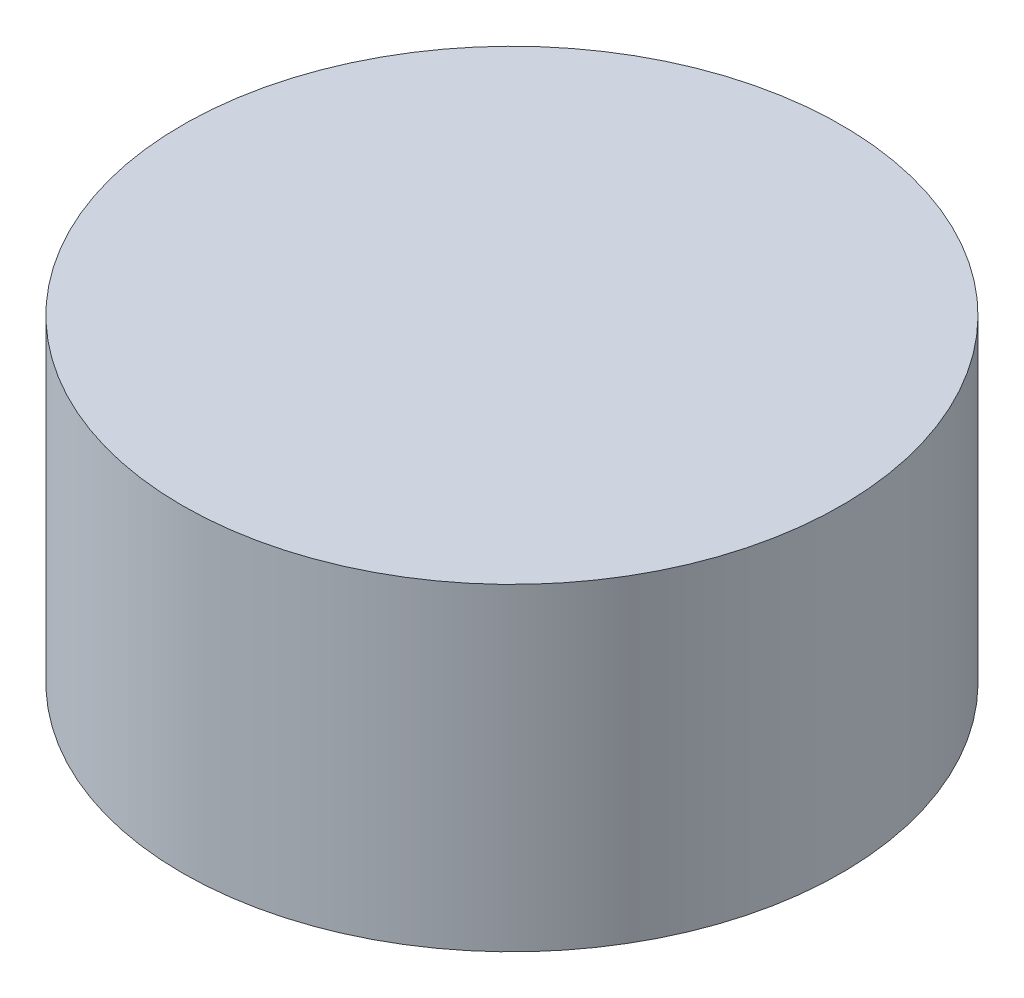
ISO-10303-21;
HEADER;
FILE_DESCRIPTION(('STEP AP214'),'2;1');
FILE_NAME('part.step','',(''),(''),'','','');
FILE_SCHEMA(('AUTOMOTIVE_DESIGN { 1 0 10303 214 1 1 1 1 }'));
ENDSEC;
DATA;
#1=APPLICATION_CONTEXT('core data for automotive mechanical design processes');
#2=APPLICATION_PROTOCOL_DEFINITION('international standard','automotive_design',2000,#1);
#3=PRODUCT_CONTEXT('',#1,'mechanical');
#4=PRODUCT('Part','Part','',(#3));
#5=PRODUCT_RELATED_PRODUCT_CATEGORY('part','',(#4));
#6=PRODUCT_DEFINITION_FORMATION('','',#4);
#7=PRODUCT_DEFINITION_CONTEXT('part definition',#1,'design');
#8=PRODUCT_DEFINITION('design','',#6,#7);
#9=PRODUCT_DEFINITION_SHAPE('','',#8);
#10=(LENGTH_UNIT() NAMED_UNIT(*) SI_UNIT(.MILLI.,.METRE.));
#11=(NAMED_UNIT(*) PLANE_ANGLE_UNIT() SI_UNIT($,.RADIAN.));
#12=(NAMED_UNIT(*) SI_UNIT($,.STERADIAN.) SOLID_ANGLE_UNIT());
#13=UNCERTAINTY_MEASURE_WITH_UNIT(LENGTH_MEASURE(1.E-05),#10,'distance_accuracy_value','');
#14=(GEOMETRIC_REPRESENTATION_CONTEXT(3) GLOBAL_UNCERTAINTY_ASSIGNED_CONTEXT((#13)) GLOBAL_UNIT_ASSIGNED_CONTEXT((#10,
#11,#12)) REPRESENTATION_CONTEXT('',''));
#15=CARTESIAN_POINT('',(0.,0.,0.));
#16=DIRECTION('',(0.,0.,1.));
#17=DIRECTION('',(1.,0.,0.));
#18=AXIS2_PLACEMENT_3D('',#15,#16,#17);
#19=CARTESIAN_POINT('',(0.,28.,0.));
#20=DIRECTION('',(0.,-1.,0.));
#21=DIRECTION('',(0.,0.,-1.));
#22=AXIS2_PLACEMENT_3D('',#19,#20,#21);
#23=CYLINDRICAL_SURFACE('',#22,29.);
#24=CARTESIAN_POINT('',(0.,28.,0.));
#25=DIRECTION('',(0.,1.,0.));
#26=DIRECTION('',(0.,0.,1.));
#27=AXIS2_PLACEMENT_3D('',#24,#25,#26);
#28=CIRCLE('',#27,29.);
#29=CARTESIAN_POINT('',(0.,28.,29.));
#30=VERTEX_POINT('',#29);
#31=EDGE_CURVE('E10',#30,#30,#28,.T.);
#32=ORIENTED_EDGE('',*,*,#31,.F.);
#33=EDGE_LOOP('',(#32));
#34=FACE_BOUND('',#33,.T.);
#35=CARTESIAN_POINT('',(0.,0.,0.));
#36=DIRECTION('',(0.,1.,0.));
#37=DIRECTION('',(0.,0.,1.));
#38=AXIS2_PLACEMENT_3D('',#35,#36,#37);
#39=CIRCLE('',#38,29.);
#40=CARTESIAN_POINT('',(0.,0.,29.));
#41=VERTEX_POINT('',#40);
#42=EDGE_CURVE('E37',#41,#41,#39,.T.);
#43=ORIENTED_EDGE('',*,*,#42,.T.);
#44=EDGE_LOOP('',(#43));
#45=FACE_BOUND('',#44,.T.);
#46=ADVANCED_FACE('F34',(#34,#45),#23,.T.);
#47=CARTESIAN_POINT('',(0.,28.,0.));
#48=DIRECTION('',(0.,1.,0.));
#49=DIRECTION('',(0.,0.,1.));
#50=AXIS2_PLACEMENT_3D('',#47,#48,#49);
#51=PLANE('',#50);
#52=ORIENTED_EDGE('',*,*,#31,.T.);
#53=EDGE_LOOP('',(#52));
#54=FACE_BOUND('',#53,.T.);
#55=ADVANCED_FACE('F49',(#54),#51,.T.);
#56=CARTESIAN_POINT('',(0.,0.,0.));
#57=DIRECTION('',(0.,1.,0.));
#58=DIRECTION('',(0.,0.,1.));
#59=AXIS2_PLACEMENT_3D('',#56,#57,#58);
#60=PLANE('',#59);
#61=ORIENTED_EDGE('',*,*,#42,.F.);
#62=EDGE_LOOP('',(#61));
#63=FACE_BOUND('',#62,.T.);
#64=ADVANCED_FACE('F47',(#63),#60,.F.);
#65=CLOSED_SHELL('',(#46,#55,#64));
#66=MANIFOLD_SOLID_BREP('B2',#65);
#67=ADVANCED_BREP_SHAPE_REPRESENTATION('',(#18,#66),#14);
#68=SHAPE_DEFINITION_REPRESENTATION(#9,#67);
ENDSEC;
END-ISO-10303-21;
